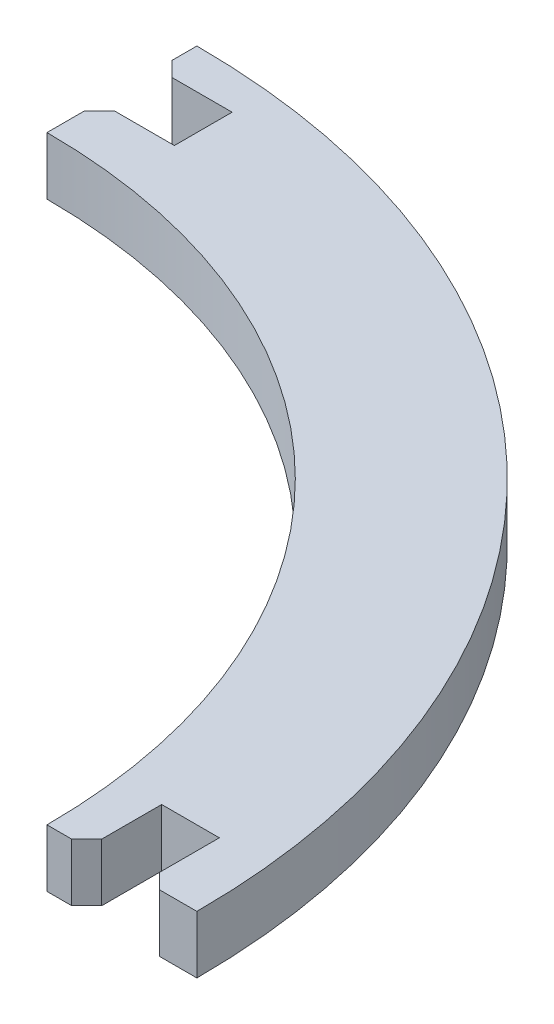
ISO-10303-21;
HEADER;
FILE_DESCRIPTION(('STEP AP214'),'2;1');
FILE_NAME('part.step','',(''),(''),'','','');
FILE_SCHEMA(('AUTOMOTIVE_DESIGN { 1 0 10303 214 1 1 1 1 }'));
ENDSEC;
DATA;
#1=APPLICATION_CONTEXT('core data for automotive mechanical design processes');
#2=APPLICATION_PROTOCOL_DEFINITION('international standard','automotive_design',2000,#1);
#3=PRODUCT_CONTEXT('',#1,'mechanical');
#4=PRODUCT('Part','Part','',(#3));
#5=PRODUCT_RELATED_PRODUCT_CATEGORY('part','',(#4));
#6=PRODUCT_DEFINITION_FORMATION('','',#4);
#7=PRODUCT_DEFINITION_CONTEXT('part definition',#1,'design');
#8=PRODUCT_DEFINITION('design','',#6,#7);
#9=PRODUCT_DEFINITION_SHAPE('','',#8);
#10=(LENGTH_UNIT() NAMED_UNIT(*) SI_UNIT(.MILLI.,.METRE.));
#11=(NAMED_UNIT(*) PLANE_ANGLE_UNIT() SI_UNIT($,.RADIAN.));
#12=(NAMED_UNIT(*) SI_UNIT($,.STERADIAN.) SOLID_ANGLE_UNIT());
#13=UNCERTAINTY_MEASURE_WITH_UNIT(LENGTH_MEASURE(1.E-05),#10,'distance_accuracy_value','');
#14=(GEOMETRIC_REPRESENTATION_CONTEXT(3) GLOBAL_UNCERTAINTY_ASSIGNED_CONTEXT((#13)) GLOBAL_UNIT_ASSIGNED_CONTEXT((#10,
#11,#12)) REPRESENTATION_CONTEXT('',''));
#15=CARTESIAN_POINT('',(0.,0.,0.));
#16=DIRECTION('',(0.,0.,1.));
#17=DIRECTION('',(1.,0.,0.));
#18=AXIS2_PLACEMENT_3D('',#15,#16,#17);
#19=CARTESIAN_POINT('',(0.,3.85,-43.5));
#20=DIRECTION('',(1.,0.,0.));
#21=DIRECTION('',(0.,0.,-1.));
#22=AXIS2_PLACEMENT_3D('',#19,#20,#21);
#23=PLANE('',#22);
#24=DIRECTION('',(0.,0.,1.));
#25=VECTOR('',#24,1.);
#26=CARTESIAN_POINT('',(0.,3.85,-43.5));
#27=LINE('',#26,#25);
#28=CARTESIAN_POINT('',(0.,3.85,-42.5));
#29=VERTEX_POINT('',#28);
#30=CARTESIAN_POINT('',(0.,3.85,-40.));
#31=VERTEX_POINT('',#30);
#32=EDGE_CURVE('E145',#29,#31,#27,.T.);
#33=ORIENTED_EDGE('',*,*,#32,.F.);
#34=DIRECTION('',(0.,-1.,0.));
#35=VECTOR('',#34,1.);
#36=CARTESIAN_POINT('',(0.,0.,-42.5));
#37=LINE('',#36,#35);
#38=CARTESIAN_POINT('',(0.,0.,-42.5));
#39=VERTEX_POINT('',#38);
#40=EDGE_CURVE('E200',#29,#39,#37,.T.);
#41=ORIENTED_EDGE('',*,*,#40,.T.);
#42=DIRECTION('',(0.,0.,1.));
#43=VECTOR('',#42,1.);
#44=CARTESIAN_POINT('',(0.,0.,-43.5));
#45=LINE('',#44,#43);
#46=CARTESIAN_POINT('',(0.,0.,-40.));
#47=VERTEX_POINT('',#46);
#48=EDGE_CURVE('E169',#39,#47,#45,.T.);
#49=ORIENTED_EDGE('',*,*,#48,.T.);
#50=DIRECTION('',(0.,-1.,0.));
#51=VECTOR('',#50,1.);
#52=CARTESIAN_POINT('',(0.,3.85,-40.));
#53=LINE('',#52,#51);
#54=EDGE_CURVE('E162',#31,#47,#53,.T.);
#55=ORIENTED_EDGE('',*,*,#54,.F.);
#56=EDGE_LOOP('',(#33,#41,#49,#55));
#57=FACE_BOUND('',#56,.T.);
#58=ADVANCED_FACE('F33',(#57),#23,.F.);
#59=CARTESIAN_POINT('',(0.,3.85,0.));
#60=DIRECTION('',(0.,-1.,0.));
#61=DIRECTION('',(0.,0.,-1.));
#62=AXIS2_PLACEMENT_3D('',#59,#60,#61);
#63=CYLINDRICAL_SURFACE('',#62,40.);
#64=CARTESIAN_POINT('',(0.,0.,0.));
#65=DIRECTION('',(0.,-1.,0.));
#66=DIRECTION('',(0.,0.,-1.));
#67=AXIS2_PLACEMENT_3D('',#64,#65,#66);
#68=CIRCLE('',#67,40.);
#69=CARTESIAN_POINT('',(40.,0.,0.));
#70=VERTEX_POINT('',#69);
#71=EDGE_CURVE('E303',#47,#70,#68,.T.);
#72=ORIENTED_EDGE('',*,*,#71,.T.);
#73=DIRECTION('',(0.,-1.,0.));
#74=VECTOR('',#73,1.);
#75=CARTESIAN_POINT('',(40.,3.85,0.));
#76=LINE('',#75,#74);
#77=CARTESIAN_POINT('',(40.,3.85,0.));
#78=VERTEX_POINT('',#77);
#79=EDGE_CURVE('E164',#78,#70,#76,.T.);
#80=ORIENTED_EDGE('',*,*,#79,.F.);
#81=CARTESIAN_POINT('',(0.,3.85,0.));
#82=DIRECTION('',(0.,-1.,0.));
#83=DIRECTION('',(0.,0.,-1.));
#84=AXIS2_PLACEMENT_3D('',#81,#82,#83);
#85=CIRCLE('',#84,40.);
#86=EDGE_CURVE('E149',#31,#78,#85,.T.);
#87=ORIENTED_EDGE('',*,*,#86,.F.);
#88=ORIENTED_EDGE('',*,*,#54,.T.);
#89=EDGE_LOOP('',(#72,#80,#87,#88));
#90=FACE_BOUND('',#89,.T.);
#91=ADVANCED_FACE('F161',(#90),#63,.F.);
#92=CARTESIAN_POINT('',(40.,3.85,0.));
#93=DIRECTION('',(0.,0.,-1.));
#94=DIRECTION('',(-1.,0.,0.));
#95=AXIS2_PLACEMENT_3D('',#92,#93,#94);
#96=PLANE('',#95);
#97=DIRECTION('',(1.,0.,0.));
#98=VECTOR('',#97,1.);
#99=CARTESIAN_POINT('',(40.,0.,0.));
#100=LINE('',#99,#98);
#101=CARTESIAN_POINT('',(41.65,0.,0.));
#102=VERTEX_POINT('',#101);
#103=EDGE_CURVE('E260',#70,#102,#100,.T.);
#104=ORIENTED_EDGE('',*,*,#103,.T.);
#105=DIRECTION('',(0.,1.,0.));
#106=VECTOR('',#105,1.);
#107=CARTESIAN_POINT('',(41.65,3.85,0.));
#108=LINE('',#107,#106);
#109=CARTESIAN_POINT('',(41.65,3.85,0.));
#110=VERTEX_POINT('',#109);
#111=EDGE_CURVE('E187',#102,#110,#108,.T.);
#112=ORIENTED_EDGE('',*,*,#111,.T.);
#113=DIRECTION('',(1.,0.,0.));
#114=VECTOR('',#113,1.);
#115=CARTESIAN_POINT('',(40.,3.85,0.));
#116=LINE('',#115,#114);
#117=EDGE_CURVE('E166',#78,#110,#116,.T.);
#118=ORIENTED_EDGE('',*,*,#117,.F.);
#119=ORIENTED_EDGE('',*,*,#79,.T.);
#120=EDGE_LOOP('',(#104,#112,#118,#119));
#121=FACE_BOUND('',#120,.T.);
#122=ADVANCED_FACE('F308',(#121),#96,.F.);
#123=CARTESIAN_POINT('',(42.65,3.85,0.));
#124=DIRECTION('',(-1.,0.,0.));
#125=DIRECTION('',(0.,0.,1.));
#126=AXIS2_PLACEMENT_3D('',#123,#124,#125);
#127=PLANE('',#126);
#128=DIRECTION('',(0.,0.,-1.));
#129=VECTOR('',#128,1.);
#130=CARTESIAN_POINT('',(42.65,3.85,0.));
#131=LINE('',#130,#129);
#132=CARTESIAN_POINT('',(42.65,3.85,-1.));
#133=VERTEX_POINT('',#132);
#134=CARTESIAN_POINT('',(42.65,3.85,-5.));
#135=VERTEX_POINT('',#134);
#136=EDGE_CURVE('E288',#133,#135,#131,.T.);
#137=ORIENTED_EDGE('',*,*,#136,.F.);
#138=DIRECTION('',(0.,-1.,0.));
#139=VECTOR('',#138,1.);
#140=CARTESIAN_POINT('',(42.65,3.85,-1.));
#141=LINE('',#140,#139);
#142=CARTESIAN_POINT('',(42.65,0.,-1.));
#143=VERTEX_POINT('',#142);
#144=EDGE_CURVE('E171',#133,#143,#141,.T.);
#145=ORIENTED_EDGE('',*,*,#144,.T.);
#146=DIRECTION('',(0.,0.,-1.));
#147=VECTOR('',#146,1.);
#148=CARTESIAN_POINT('',(42.65,0.,0.));
#149=LINE('',#148,#147);
#150=CARTESIAN_POINT('',(42.65,0.,-5.));
#151=VERTEX_POINT('',#150);
#152=EDGE_CURVE('E254',#143,#151,#149,.T.);
#153=ORIENTED_EDGE('',*,*,#152,.T.);
#154=DIRECTION('',(0.,-1.,0.));
#155=VECTOR('',#154,1.);
#156=CARTESIAN_POINT('',(42.65,3.85,-5.));
#157=LINE('',#156,#155);
#158=EDGE_CURVE('E176',#135,#151,#157,.T.);
#159=ORIENTED_EDGE('',*,*,#158,.F.);
#160=EDGE_LOOP('',(#137,#145,#153,#159));
#161=FACE_BOUND('',#160,.T.);
#162=ADVANCED_FACE('F313',(#161),#127,.F.);
#163=CARTESIAN_POINT('',(42.65,3.85,-5.));
#164=DIRECTION('',(0.,0.,-1.));
#165=DIRECTION('',(-1.,0.,0.));
#166=AXIS2_PLACEMENT_3D('',#163,#164,#165);
#167=PLANE('',#166);
#168=DIRECTION('',(1.,0.,0.));
#169=VECTOR('',#168,1.);
#170=CARTESIAN_POINT('',(42.65,0.,-5.));
#171=LINE('',#170,#169);
#172=CARTESIAN_POINT('',(46.5,0.,-5.));
#173=VERTEX_POINT('',#172);
#174=EDGE_CURVE('E249',#151,#173,#171,.T.);
#175=ORIENTED_EDGE('',*,*,#174,.T.);
#176=DIRECTION('',(0.,-1.,0.));
#177=VECTOR('',#176,1.);
#178=CARTESIAN_POINT('',(46.5,3.85,-5.));
#179=LINE('',#178,#177);
#180=CARTESIAN_POINT('',(46.5,3.85,-5.));
#181=VERTEX_POINT('',#180);
#182=EDGE_CURVE('E239',#181,#173,#179,.T.);
#183=ORIENTED_EDGE('',*,*,#182,.F.);
#184=DIRECTION('',(1.,0.,0.));
#185=VECTOR('',#184,1.);
#186=CARTESIAN_POINT('',(42.65,3.85,-5.));
#187=LINE('',#186,#185);
#188=EDGE_CURVE('E251',#135,#181,#187,.T.);
#189=ORIENTED_EDGE('',*,*,#188,.F.);
#190=ORIENTED_EDGE('',*,*,#158,.T.);
#191=EDGE_LOOP('',(#175,#183,#189,#190));
#192=FACE_BOUND('',#191,.T.);
#193=ADVANCED_FACE('F247',(#192),#167,.F.);
#194=CARTESIAN_POINT('',(46.5,3.85,0.));
#195=DIRECTION('',(-1.,0.,0.));
#196=DIRECTION('',(0.,0.,1.));
#197=AXIS2_PLACEMENT_3D('',#194,#195,#196);
#198=PLANE('',#197);
#199=DIRECTION('',(0.,0.,-1.));
#200=VECTOR('',#199,1.);
#201=CARTESIAN_POINT('',(46.5,0.,0.));
#202=LINE('',#201,#200);
#203=CARTESIAN_POINT('',(46.5,0.,-1.00000000000001));
#204=VERTEX_POINT('',#203);
#205=EDGE_CURVE('E256',#204,#173,#202,.T.);
#206=ORIENTED_EDGE('',*,*,#205,.F.);
#207=DIRECTION('',(0.,1.,0.));
#208=VECTOR('',#207,1.);
#209=CARTESIAN_POINT('',(46.5,3.85,-1.00000000000001));
#210=LINE('',#209,#208);
#211=CARTESIAN_POINT('',(46.5,3.85,-1.00000000000001));
#212=VERTEX_POINT('',#211);
#213=EDGE_CURVE('E198',#204,#212,#210,.T.);
#214=ORIENTED_EDGE('',*,*,#213,.T.);
#215=DIRECTION('',(0.,0.,-1.));
#216=VECTOR('',#215,1.);
#217=CARTESIAN_POINT('',(46.5,3.85,0.));
#218=LINE('',#217,#216);
#219=EDGE_CURVE('E286',#212,#181,#218,.T.);
#220=ORIENTED_EDGE('',*,*,#219,.T.);
#221=ORIENTED_EDGE('',*,*,#182,.T.);
#222=EDGE_LOOP('',(#206,#214,#220,#221));
#223=FACE_BOUND('',#222,.T.);
#224=ADVANCED_FACE('F284',(#223),#198,.T.);
#225=CARTESIAN_POINT('',(46.5,3.85,0.));
#226=DIRECTION('',(0.,0.,-1.));
#227=DIRECTION('',(-1.,0.,0.));
#228=AXIS2_PLACEMENT_3D('',#225,#226,#227);
#229=PLANE('',#228);
#230=DIRECTION('',(1.,0.,0.));
#231=VECTOR('',#230,1.);
#232=CARTESIAN_POINT('',(46.5,3.85,0.));
#233=LINE('',#232,#231);
#234=CARTESIAN_POINT('',(47.5,3.85,0.));
#235=VERTEX_POINT('',#234);
#236=CARTESIAN_POINT('',(50.,3.85,0.));
#237=VERTEX_POINT('',#236);
#238=EDGE_CURVE('E277',#235,#237,#233,.T.);
#239=ORIENTED_EDGE('',*,*,#238,.F.);
#240=DIRECTION('',(0.,-1.,0.));
#241=VECTOR('',#240,1.);
#242=CARTESIAN_POINT('',(47.5,0.,0.));
#243=LINE('',#242,#241);
#244=CARTESIAN_POINT('',(47.5,0.,0.));
#245=VERTEX_POINT('',#244);
#246=EDGE_CURVE('E195',#235,#245,#243,.T.);
#247=ORIENTED_EDGE('',*,*,#246,.T.);
#248=DIRECTION('',(1.,0.,0.));
#249=VECTOR('',#248,1.);
#250=CARTESIAN_POINT('',(46.5,0.,0.));
#251=LINE('',#250,#249);
#252=CARTESIAN_POINT('',(50.,0.,0.));
#253=VERTEX_POINT('',#252);
#254=EDGE_CURVE('E258',#245,#253,#251,.T.);
#255=ORIENTED_EDGE('',*,*,#254,.T.);
#256=DIRECTION('',(0.,-1.,0.));
#257=VECTOR('',#256,1.);
#258=CARTESIAN_POINT('',(50.,3.85,0.));
#259=LINE('',#258,#257);
#260=EDGE_CURVE('E236',#237,#253,#259,.T.);
#261=ORIENTED_EDGE('',*,*,#260,.F.);
#262=EDGE_LOOP('',(#239,#247,#255,#261));
#263=FACE_BOUND('',#262,.T.);
#264=ADVANCED_FACE('F276',(#263),#229,.F.);
#265=CARTESIAN_POINT('',(0.,3.85,0.));
#266=DIRECTION('',(0.,-1.,0.));
#267=DIRECTION('',(0.,0.,-1.));
#268=AXIS2_PLACEMENT_3D('',#265,#266,#267);
#269=CYLINDRICAL_SURFACE('',#268,50.);
#270=CARTESIAN_POINT('',(0.,0.,0.));
#271=DIRECTION('',(0.,-1.,0.));
#272=DIRECTION('',(0.,0.,-1.));
#273=AXIS2_PLACEMENT_3D('',#270,#271,#272);
#274=CIRCLE('',#273,50.);
#275=CARTESIAN_POINT('',(0.,0.,-50.));
#276=VERTEX_POINT('',#275);
#277=EDGE_CURVE('E223',#276,#253,#274,.T.);
#278=ORIENTED_EDGE('',*,*,#277,.F.);
#279=DIRECTION('',(0.,-1.,0.));
#280=VECTOR('',#279,1.);
#281=CARTESIAN_POINT('',(0.,3.85,-50.));
#282=LINE('',#281,#280);
#283=CARTESIAN_POINT('',(0.,3.85,-50.));
#284=VERTEX_POINT('',#283);
#285=EDGE_CURVE('E234',#284,#276,#282,.T.);
#286=ORIENTED_EDGE('',*,*,#285,.F.);
#287=CARTESIAN_POINT('',(0.,3.85,0.));
#288=DIRECTION('',(0.,-1.,0.));
#289=DIRECTION('',(0.,0.,-1.));
#290=AXIS2_PLACEMENT_3D('',#287,#288,#289);
#291=CIRCLE('',#290,50.);
#292=EDGE_CURVE('E273',#284,#237,#291,.T.);
#293=ORIENTED_EDGE('',*,*,#292,.T.);
#294=ORIENTED_EDGE('',*,*,#260,.T.);
#295=EDGE_LOOP('',(#278,#286,#293,#294));
#296=FACE_BOUND('',#295,.T.);
#297=ADVANCED_FACE('F268',(#296),#269,.T.);
#298=CARTESIAN_POINT('',(0.,3.85,-50.));
#299=DIRECTION('',(1.,0.,0.));
#300=DIRECTION('',(0.,0.,-1.));
#301=AXIS2_PLACEMENT_3D('',#298,#299,#300);
#302=PLANE('',#301);
#303=DIRECTION('',(0.,0.,1.));
#304=VECTOR('',#303,1.);
#305=CARTESIAN_POINT('',(0.,0.,-50.));
#306=LINE('',#305,#304);
#307=CARTESIAN_POINT('',(0.,0.,-48.35));
#308=VERTEX_POINT('',#307);
#309=EDGE_CURVE('E220',#276,#308,#306,.T.);
#310=ORIENTED_EDGE('',*,*,#309,.T.);
#311=DIRECTION('',(0.,1.,0.));
#312=VECTOR('',#311,1.);
#313=CARTESIAN_POINT('',(0.,3.85,-48.35));
#314=LINE('',#313,#312);
#315=CARTESIAN_POINT('',(0.,3.85,-48.35));
#316=VERTEX_POINT('',#315);
#317=EDGE_CURVE('E11',#308,#316,#314,.T.);
#318=ORIENTED_EDGE('',*,*,#317,.T.);
#319=DIRECTION('',(0.,0.,1.));
#320=VECTOR('',#319,1.);
#321=CARTESIAN_POINT('',(0.,3.85,-50.));
#322=LINE('',#321,#320);
#323=EDGE_CURVE('E295',#284,#316,#322,.T.);
#324=ORIENTED_EDGE('',*,*,#323,.F.);
#325=ORIENTED_EDGE('',*,*,#285,.T.);
#326=EDGE_LOOP('',(#310,#318,#324,#325));
#327=FACE_BOUND('',#326,.T.);
#328=ADVANCED_FACE('F350',(#327),#302,.F.);
#329=CARTESIAN_POINT('',(0.,3.85,-47.35));
#330=DIRECTION('',(0.,0.,-1.));
#331=DIRECTION('',(-1.,0.,0.));
#332=AXIS2_PLACEMENT_3D('',#329,#330,#331);
#333=PLANE('',#332);
#334=DIRECTION('',(1.,0.,0.));
#335=VECTOR('',#334,1.);
#336=CARTESIAN_POINT('',(0.,3.85,-47.35));
#337=LINE('',#336,#335);
#338=CARTESIAN_POINT('',(0.999999999999999,3.85,-47.35));
#339=VERTEX_POINT('',#338);
#340=CARTESIAN_POINT('',(5.,3.85,-47.35));
#341=VERTEX_POINT('',#340);
#342=EDGE_CURVE('E210',#339,#341,#337,.T.);
#343=ORIENTED_EDGE('',*,*,#342,.F.);
#344=DIRECTION('',(0.,-1.,0.));
#345=VECTOR('',#344,1.);
#346=CARTESIAN_POINT('',(0.999999999999999,3.85,-47.35));
#347=LINE('',#346,#345);
#348=CARTESIAN_POINT('',(0.999999999999999,0.,-47.35));
#349=VERTEX_POINT('',#348);
#350=EDGE_CURVE('E41',#339,#349,#347,.T.);
#351=ORIENTED_EDGE('',*,*,#350,.T.);
#352=DIRECTION('',(1.,0.,0.));
#353=VECTOR('',#352,1.);
#354=CARTESIAN_POINT('',(0.,0.,-47.35));
#355=LINE('',#354,#353);
#356=CARTESIAN_POINT('',(5.,0.,-47.35));
#357=VERTEX_POINT('',#356);
#358=EDGE_CURVE('E208',#349,#357,#355,.T.);
#359=ORIENTED_EDGE('',*,*,#358,.T.);
#360=DIRECTION('',(0.,-1.,0.));
#361=VECTOR('',#360,1.);
#362=CARTESIAN_POINT('',(5.,3.85,-47.35));
#363=LINE('',#362,#361);
#364=EDGE_CURVE('E231',#341,#357,#363,.T.);
#365=ORIENTED_EDGE('',*,*,#364,.F.);
#366=EDGE_LOOP('',(#343,#351,#359,#365));
#367=FACE_BOUND('',#366,.T.);
#368=ADVANCED_FACE('F206',(#367),#333,.F.);
#369=CARTESIAN_POINT('',(5.,3.85,-47.35));
#370=DIRECTION('',(1.,0.,0.));
#371=DIRECTION('',(0.,0.,-1.));
#372=AXIS2_PLACEMENT_3D('',#369,#370,#371);
#373=PLANE('',#372);
#374=DIRECTION('',(0.,0.,1.));
#375=VECTOR('',#374,1.);
#376=CARTESIAN_POINT('',(5.,0.,-47.35));
#377=LINE('',#376,#375);
#378=CARTESIAN_POINT('',(5.,0.,-43.5));
#379=VERTEX_POINT('',#378);
#380=EDGE_CURVE('E219',#357,#379,#377,.T.);
#381=ORIENTED_EDGE('',*,*,#380,.T.);
#382=DIRECTION('',(0.,-1.,0.));
#383=VECTOR('',#382,1.);
#384=CARTESIAN_POINT('',(5.,3.85,-43.5));
#385=LINE('',#384,#383);
#386=CARTESIAN_POINT('',(5.,3.85,-43.5));
#387=VERTEX_POINT('',#386);
#388=EDGE_CURVE('E228',#387,#379,#385,.T.);
#389=ORIENTED_EDGE('',*,*,#388,.F.);
#390=DIRECTION('',(0.,0.,1.));
#391=VECTOR('',#390,1.);
#392=CARTESIAN_POINT('',(5.,3.85,-47.35));
#393=LINE('',#392,#391);
#394=EDGE_CURVE('E298',#341,#387,#393,.T.);
#395=ORIENTED_EDGE('',*,*,#394,.F.);
#396=ORIENTED_EDGE('',*,*,#364,.T.);
#397=EDGE_LOOP('',(#381,#389,#395,#396));
#398=FACE_BOUND('',#397,.T.);
#399=ADVANCED_FACE('F342',(#398),#373,.F.);
#400=CARTESIAN_POINT('',(0.,3.85,-43.5));
#401=DIRECTION('',(0.,0.,-1.));
#402=DIRECTION('',(-1.,0.,0.));
#403=AXIS2_PLACEMENT_3D('',#400,#401,#402);
#404=PLANE('',#403);
#405=DIRECTION('',(1.,0.,0.));
#406=VECTOR('',#405,1.);
#407=CARTESIAN_POINT('',(0.,0.,-43.5));
#408=LINE('',#407,#406);
#409=CARTESIAN_POINT('',(1.00000000000002,0.,-43.5));
#410=VERTEX_POINT('',#409);
#411=EDGE_CURVE('E157',#410,#379,#408,.T.);
#412=ORIENTED_EDGE('',*,*,#411,.F.);
#413=DIRECTION('',(0.,1.,0.));
#414=VECTOR('',#413,1.);
#415=CARTESIAN_POINT('',(1.00000000000002,3.85,-43.5));
#416=LINE('',#415,#414);
#417=CARTESIAN_POINT('',(1.00000000000002,3.85,-43.5));
#418=VERTEX_POINT('',#417);
#419=EDGE_CURVE('E48',#410,#418,#416,.T.);
#420=ORIENTED_EDGE('',*,*,#419,.T.);
#421=DIRECTION('',(1.,0.,0.));
#422=VECTOR('',#421,1.);
#423=CARTESIAN_POINT('',(0.,3.85,-43.5));
#424=LINE('',#423,#422);
#425=EDGE_CURVE('E232',#418,#387,#424,.T.);
#426=ORIENTED_EDGE('',*,*,#425,.T.);
#427=ORIENTED_EDGE('',*,*,#388,.T.);
#428=EDGE_LOOP('',(#412,#420,#426,#427));
#429=FACE_BOUND('',#428,.T.);
#430=ADVANCED_FACE('F338',(#429),#404,.T.);
#431=CARTESIAN_POINT('',(0.,3.85,0.));
#432=DIRECTION('',(0.,-1.,0.));
#433=DIRECTION('',(0.,0.,-1.));
#434=AXIS2_PLACEMENT_3D('',#431,#432,#433);
#435=PLANE('',#434);
#436=ORIENTED_EDGE('',*,*,#117,.T.);
#437=DIRECTION('',(-0.70710678118655,0.,0.707106781186545));
#438=VECTOR('',#437,1.);
#439=CARTESIAN_POINT('',(42.65,3.85,-1.));
#440=LINE('',#439,#438);
#441=EDGE_CURVE('E193',#110,#133,#440,.F.);
#442=ORIENTED_EDGE('',*,*,#441,.T.);
#443=ORIENTED_EDGE('',*,*,#136,.T.);
#444=ORIENTED_EDGE('',*,*,#188,.T.);
#445=ORIENTED_EDGE('',*,*,#219,.F.);
#446=DIRECTION('',(0.707106781186543,0.,0.707106781186552));
#447=VECTOR('',#446,1.);
#448=CARTESIAN_POINT('',(47.5,3.85,0.));
#449=LINE('',#448,#447);
#450=EDGE_CURVE('E191',#212,#235,#449,.T.);
#451=ORIENTED_EDGE('',*,*,#450,.T.);
#452=ORIENTED_EDGE('',*,*,#238,.T.);
#453=ORIENTED_EDGE('',*,*,#292,.F.);
#454=ORIENTED_EDGE('',*,*,#323,.T.);
#455=DIRECTION('',(-0.707106781186545,0.,-0.70710678118655));
#456=VECTOR('',#455,1.);
#457=CARTESIAN_POINT('',(1.,3.85,-47.35));
#458=LINE('',#457,#456);
#459=EDGE_CURVE('E56',#316,#339,#458,.F.);
#460=ORIENTED_EDGE('',*,*,#459,.T.);
#461=ORIENTED_EDGE('',*,*,#342,.T.);
#462=ORIENTED_EDGE('',*,*,#394,.T.);
#463=ORIENTED_EDGE('',*,*,#425,.F.);
#464=DIRECTION('',(-0.70710678118655,0.,0.707106781186545));
#465=VECTOR('',#464,1.);
#466=CARTESIAN_POINT('',(0.,3.85,-42.5));
#467=LINE('',#466,#465);
#468=EDGE_CURVE('E152',#418,#29,#467,.T.);
#469=ORIENTED_EDGE('',*,*,#468,.T.);
#470=ORIENTED_EDGE('',*,*,#32,.T.);
#471=ORIENTED_EDGE('',*,*,#86,.T.);
#472=EDGE_LOOP('',(#436,#442,#443,#444,#445,#451,#452,#453,#454,#460,#461,#462,#463,#469,#470,#471));
#473=FACE_BOUND('',#472,.T.);
#474=ADVANCED_FACE('F148',(#473),#435,.F.);
#475=CARTESIAN_POINT('',(0.,0.,0.));
#476=DIRECTION('',(0.,-1.,0.));
#477=DIRECTION('',(0.,0.,-1.));
#478=AXIS2_PLACEMENT_3D('',#475,#476,#477);
#479=PLANE('',#478);
#480=ORIENTED_EDGE('',*,*,#152,.F.);
#481=DIRECTION('',(0.70710678118655,0.,-0.707106781186545));
#482=VECTOR('',#481,1.);
#483=CARTESIAN_POINT('',(20.8249999999998,0.,20.825));
#484=LINE('',#483,#482);
#485=EDGE_CURVE('E185',#143,#102,#484,.F.);
#486=ORIENTED_EDGE('',*,*,#485,.T.);
#487=ORIENTED_EDGE('',*,*,#103,.F.);
#488=ORIENTED_EDGE('',*,*,#71,.F.);
#489=ORIENTED_EDGE('',*,*,#48,.F.);
#490=DIRECTION('',(0.70710678118655,0.,-0.707106781186545));
#491=VECTOR('',#490,1.);
#492=CARTESIAN_POINT('',(-21.25,0.,-21.2500000000001));
#493=LINE('',#492,#491);
#494=EDGE_CURVE('E181',#39,#410,#493,.T.);
#495=ORIENTED_EDGE('',*,*,#494,.T.);
#496=ORIENTED_EDGE('',*,*,#411,.T.);
#497=ORIENTED_EDGE('',*,*,#380,.F.);
#498=ORIENTED_EDGE('',*,*,#358,.F.);
#499=DIRECTION('',(0.707106781186545,0.,0.70710678118655));
#500=VECTOR('',#499,1.);
#501=CARTESIAN_POINT('',(24.175,0.,-24.1749999999998));
#502=LINE('',#501,#500);
#503=EDGE_CURVE('E174',#349,#308,#502,.F.);
#504=ORIENTED_EDGE('',*,*,#503,.T.);
#505=ORIENTED_EDGE('',*,*,#309,.F.);
#506=ORIENTED_EDGE('',*,*,#277,.T.);
#507=ORIENTED_EDGE('',*,*,#254,.F.);
#508=DIRECTION('',(-0.707106781186543,0.,-0.707106781186552));
#509=VECTOR('',#508,1.);
#510=CARTESIAN_POINT('',(23.7500000000003,0.,-23.75));
#511=LINE('',#510,#509);
#512=EDGE_CURVE('E183',#245,#204,#511,.T.);
#513=ORIENTED_EDGE('',*,*,#512,.T.);
#514=ORIENTED_EDGE('',*,*,#205,.T.);
#515=ORIENTED_EDGE('',*,*,#174,.F.);
#516=EDGE_LOOP('',(#480,#486,#487,#488,#489,#495,#496,#497,#498,#504,#505,#506,#507,#513,#514,#515));
#517=FACE_BOUND('',#516,.T.);
#518=ADVANCED_FACE('F215',(#517),#479,.T.);
#519=CARTESIAN_POINT('',(42.65,3.85,-1.));
#520=DIRECTION('',(-0.707106781186545,0.,-0.70710678118655));
#521=DIRECTION('',(0.,-1.,0.));
#522=AXIS2_PLACEMENT_3D('',#519,#520,#521);
#523=PLANE('',#522);
#524=ORIENTED_EDGE('',*,*,#441,.F.);
#525=ORIENTED_EDGE('',*,*,#111,.F.);
#526=ORIENTED_EDGE('',*,*,#485,.F.);
#527=ORIENTED_EDGE('',*,*,#144,.F.);
#528=EDGE_LOOP('',(#524,#525,#526,#527));
#529=FACE_BOUND('',#528,.T.);
#530=ADVANCED_FACE('F311',(#529),#523,.F.);
#531=CARTESIAN_POINT('',(47.5,3.85,0.));
#532=DIRECTION('',(-0.707106781186552,0.,0.707106781186542));
#533=DIRECTION('',(0.,1.,0.));
#534=AXIS2_PLACEMENT_3D('',#531,#532,#533);
#535=PLANE('',#534);
#536=ORIENTED_EDGE('',*,*,#450,.F.);
#537=ORIENTED_EDGE('',*,*,#213,.F.);
#538=ORIENTED_EDGE('',*,*,#512,.F.);
#539=ORIENTED_EDGE('',*,*,#246,.F.);
#540=EDGE_LOOP('',(#536,#537,#538,#539));
#541=FACE_BOUND('',#540,.T.);
#542=ADVANCED_FACE('F281',(#541),#535,.T.);
#543=CARTESIAN_POINT('',(0.,3.85,-42.5));
#544=DIRECTION('',(-0.707106781186545,0.,-0.70710678118655));
#545=DIRECTION('',(0.,1.,0.));
#546=AXIS2_PLACEMENT_3D('',#543,#544,#545);
#547=PLANE('',#546);
#548=ORIENTED_EDGE('',*,*,#468,.F.);
#549=ORIENTED_EDGE('',*,*,#419,.F.);
#550=ORIENTED_EDGE('',*,*,#494,.F.);
#551=ORIENTED_EDGE('',*,*,#40,.F.);
#552=EDGE_LOOP('',(#548,#549,#550,#551));
#553=FACE_BOUND('',#552,.T.);
#554=ADVANCED_FACE('F332',(#553),#547,.T.);
#555=CARTESIAN_POINT('',(1.,3.85,-47.35));
#556=DIRECTION('',(0.70710678118655,0.,-0.707106781186545));
#557=DIRECTION('',(0.,-1.,0.));
#558=AXIS2_PLACEMENT_3D('',#555,#556,#557);
#559=PLANE('',#558);
#560=ORIENTED_EDGE('',*,*,#459,.F.);
#561=ORIENTED_EDGE('',*,*,#317,.F.);
#562=ORIENTED_EDGE('',*,*,#503,.F.);
#563=ORIENTED_EDGE('',*,*,#350,.F.);
#564=EDGE_LOOP('',(#560,#561,#562,#563));
#565=FACE_BOUND('',#564,.T.);
#566=ADVANCED_FACE('F35',(#565),#559,.F.);
#567=CLOSED_SHELL('',(#58,#91,#122,#162,#193,#224,#264,#297,#328,#368,#399,#430,#474,#518,#530,
#542,#554,#566));
#568=MANIFOLD_SOLID_BREP('B2',#567);
#569=ADVANCED_BREP_SHAPE_REPRESENTATION('',(#18,#568),#14);
#570=SHAPE_DEFINITION_REPRESENTATION(#9,#569);
ENDSEC;
END-ISO-10303-21;
